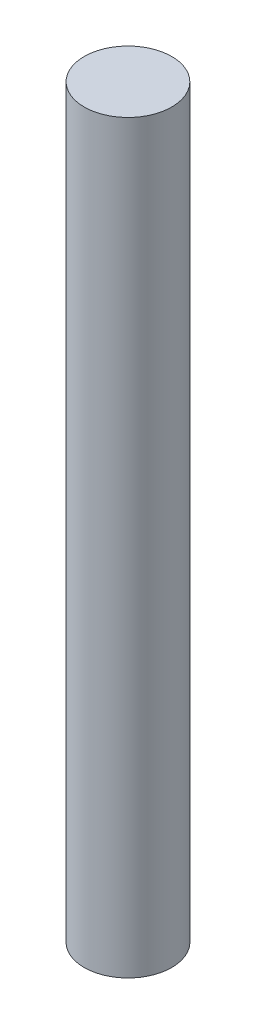
ISO-10303-21;
HEADER;
FILE_DESCRIPTION(('STEP AP214'),'2;1');
FILE_NAME('part.step','',(''),(''),'','','');
FILE_SCHEMA(('AUTOMOTIVE_DESIGN { 1 0 10303 214 1 1 1 1 }'));
ENDSEC;
DATA;
#1=APPLICATION_CONTEXT('core data for automotive mechanical design processes');
#2=APPLICATION_PROTOCOL_DEFINITION('international standard','automotive_design',2000,#1);
#3=PRODUCT_CONTEXT('',#1,'mechanical');
#4=PRODUCT('Part','Part','',(#3));
#5=PRODUCT_RELATED_PRODUCT_CATEGORY('part','',(#4));
#6=PRODUCT_DEFINITION_FORMATION('','',#4);
#7=PRODUCT_DEFINITION_CONTEXT('part definition',#1,'design');
#8=PRODUCT_DEFINITION('design','',#6,#7);
#9=PRODUCT_DEFINITION_SHAPE('','',#8);
#10=(LENGTH_UNIT() NAMED_UNIT(*) SI_UNIT(.MILLI.,.METRE.));
#11=(NAMED_UNIT(*) PLANE_ANGLE_UNIT() SI_UNIT($,.RADIAN.));
#12=(NAMED_UNIT(*) SI_UNIT($,.STERADIAN.) SOLID_ANGLE_UNIT());
#13=UNCERTAINTY_MEASURE_WITH_UNIT(LENGTH_MEASURE(1.E-05),#10,'distance_accuracy_value','');
#14=(GEOMETRIC_REPRESENTATION_CONTEXT(3) GLOBAL_UNCERTAINTY_ASSIGNED_CONTEXT((#13)) GLOBAL_UNIT_ASSIGNED_CONTEXT((#10,
#11,#12)) REPRESENTATION_CONTEXT('',''));
#15=CARTESIAN_POINT('',(0.,0.,0.));
#16=DIRECTION('',(0.,0.,1.));
#17=DIRECTION('',(1.,0.,0.));
#18=AXIS2_PLACEMENT_3D('',#15,#16,#17);
#19=CARTESIAN_POINT('',(0.,101.72,0.));
#20=DIRECTION('',(0.,-1.,0.));
#21=DIRECTION('',(0.,0.,-1.));
#22=AXIS2_PLACEMENT_3D('',#19,#20,#21);
#23=CYLINDRICAL_SURFACE('',#22,5.975);
#24=CARTESIAN_POINT('',(0.,101.72,0.));
#25=DIRECTION('',(0.,1.,0.));
#26=DIRECTION('',(0.,0.,1.));
#27=AXIS2_PLACEMENT_3D('',#24,#25,#26);
#28=CIRCLE('',#27,5.975);
#29=CARTESIAN_POINT('',(0.,101.72,5.975));
#30=VERTEX_POINT('',#29);
#31=EDGE_CURVE('E10',#30,#30,#28,.T.);
#32=ORIENTED_EDGE('',*,*,#31,.F.);
#33=EDGE_LOOP('',(#32));
#34=FACE_BOUND('',#33,.T.);
#35=CARTESIAN_POINT('',(0.,0.,0.));
#36=DIRECTION('',(0.,1.,0.));
#37=DIRECTION('',(0.,0.,1.));
#38=AXIS2_PLACEMENT_3D('',#35,#36,#37);
#39=CIRCLE('',#38,5.975);
#40=CARTESIAN_POINT('',(0.,0.,5.975));
#41=VERTEX_POINT('',#40);
#42=EDGE_CURVE('E34',#41,#41,#39,.T.);
#43=ORIENTED_EDGE('',*,*,#42,.T.);
#44=EDGE_LOOP('',(#43));
#45=FACE_BOUND('',#44,.T.);
#46=ADVANCED_FACE('F31',(#34,#45),#23,.T.);
#47=CARTESIAN_POINT('',(0.,101.72,0.));
#48=DIRECTION('',(0.,1.,0.));
#49=DIRECTION('',(0.,0.,1.));
#50=AXIS2_PLACEMENT_3D('',#47,#48,#49);
#51=PLANE('',#50);
#52=ORIENTED_EDGE('',*,*,#31,.T.);
#53=EDGE_LOOP('',(#52));
#54=FACE_BOUND('',#53,.T.);
#55=ADVANCED_FACE('F46',(#54),#51,.T.);
#56=CARTESIAN_POINT('',(0.,0.,0.));
#57=DIRECTION('',(0.,1.,0.));
#58=DIRECTION('',(0.,0.,1.));
#59=AXIS2_PLACEMENT_3D('',#56,#57,#58);
#60=PLANE('',#59);
#61=ORIENTED_EDGE('',*,*,#42,.F.);
#62=EDGE_LOOP('',(#61));
#63=FACE_BOUND('',#62,.T.);
#64=ADVANCED_FACE('F44',(#63),#60,.F.);
#65=CLOSED_SHELL('',(#46,#55,#64));
#66=MANIFOLD_SOLID_BREP('B2',#65);
#67=ADVANCED_BREP_SHAPE_REPRESENTATION('',(#18,#66),#14);
#68=SHAPE_DEFINITION_REPRESENTATION(#9,#67);
ENDSEC;
END-ISO-10303-21;
